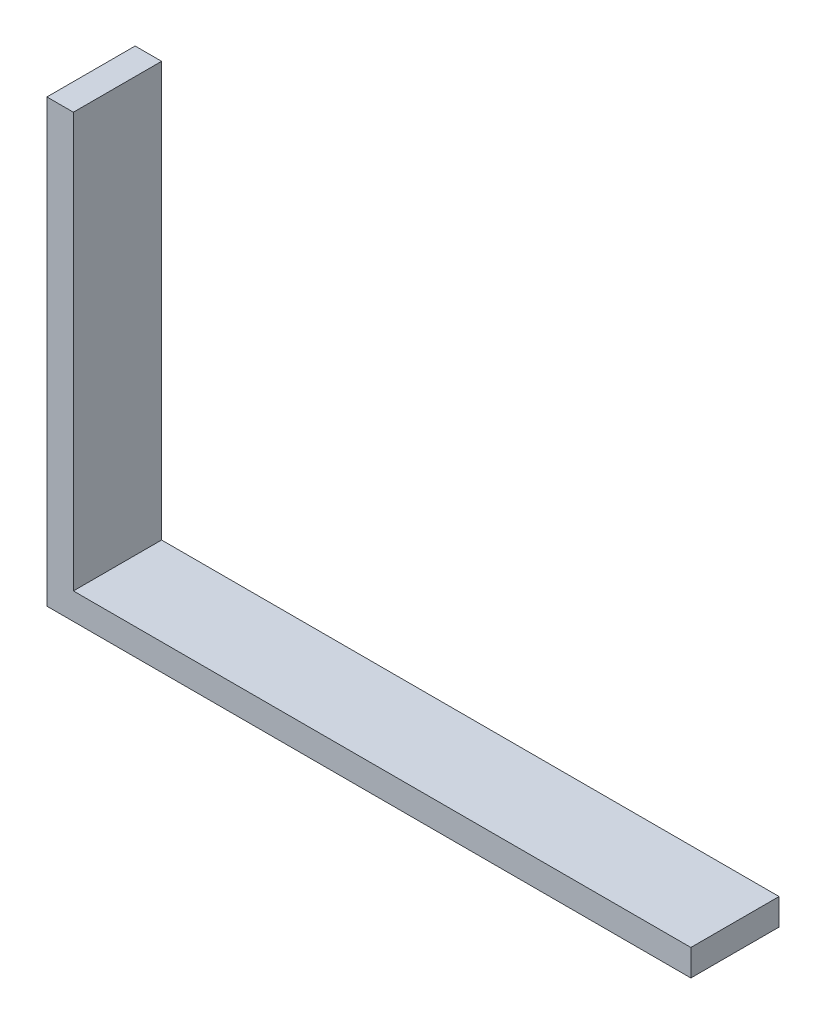
ISO-10303-21;
HEADER;
FILE_DESCRIPTION(('STEP AP214'),'2;1');
FILE_NAME('part.step','',(''),(''),'','','');
FILE_SCHEMA(('AUTOMOTIVE_DESIGN { 1 0 10303 214 1 1 1 1 }'));
ENDSEC;
DATA;
#1=APPLICATION_CONTEXT('core data for automotive mechanical design processes');
#2=APPLICATION_PROTOCOL_DEFINITION('international standard','automotive_design',2000,#1);
#3=PRODUCT_CONTEXT('',#1,'mechanical');
#4=PRODUCT('Part','Part','',(#3));
#5=PRODUCT_RELATED_PRODUCT_CATEGORY('part','',(#4));
#6=PRODUCT_DEFINITION_FORMATION('','',#4);
#7=PRODUCT_DEFINITION_CONTEXT('part definition',#1,'design');
#8=PRODUCT_DEFINITION('design','',#6,#7);
#9=PRODUCT_DEFINITION_SHAPE('','',#8);
#10=(LENGTH_UNIT() NAMED_UNIT(*) SI_UNIT(.MILLI.,.METRE.));
#11=(NAMED_UNIT(*) PLANE_ANGLE_UNIT() SI_UNIT($,.RADIAN.));
#12=(NAMED_UNIT(*) SI_UNIT($,.STERADIAN.) SOLID_ANGLE_UNIT());
#13=UNCERTAINTY_MEASURE_WITH_UNIT(LENGTH_MEASURE(1.E-05),#10,'distance_accuracy_value','');
#14=(GEOMETRIC_REPRESENTATION_CONTEXT(3) GLOBAL_UNCERTAINTY_ASSIGNED_CONTEXT((#13)) GLOBAL_UNIT_ASSIGNED_CONTEXT((#10,
#11,#12)) REPRESENTATION_CONTEXT('',''));
#15=CARTESIAN_POINT('',(0.,0.,0.));
#16=DIRECTION('',(0.,0.,1.));
#17=DIRECTION('',(1.,0.,0.));
#18=AXIS2_PLACEMENT_3D('',#15,#16,#17);
#19=CARTESIAN_POINT('',(73.,0.,10.));
#20=DIRECTION('',(0.,1.,0.));
#21=DIRECTION('',(-1.,0.,0.));
#22=AXIS2_PLACEMENT_3D('',#19,#20,#21);
#23=PLANE('',#22);
#24=DIRECTION('',(1.,0.,0.));
#25=VECTOR('',#24,1.);
#26=CARTESIAN_POINT('',(73.,0.,0.));
#27=LINE('',#26,#25);
#28=CARTESIAN_POINT('',(0.,0.,0.));
#29=VERTEX_POINT('',#28);
#30=CARTESIAN_POINT('',(73.,0.,0.));
#31=VERTEX_POINT('',#30);
#32=EDGE_CURVE('E117',#29,#31,#27,.T.);
#33=ORIENTED_EDGE('',*,*,#32,.T.);
#34=DIRECTION('',(0.,0.,-1.));
#35=VECTOR('',#34,1.);
#36=CARTESIAN_POINT('',(73.,0.,10.));
#37=LINE('',#36,#35);
#38=CARTESIAN_POINT('',(73.,0.,10.));
#39=VERTEX_POINT('',#38);
#40=EDGE_CURVE('E11',#39,#31,#37,.T.);
#41=ORIENTED_EDGE('',*,*,#40,.F.);
#42=DIRECTION('',(1.,0.,0.));
#43=VECTOR('',#42,1.);
#44=CARTESIAN_POINT('',(73.,0.,10.));
#45=LINE('',#44,#43);
#46=CARTESIAN_POINT('',(0.,0.,10.));
#47=VERTEX_POINT('',#46);
#48=EDGE_CURVE('E127',#47,#39,#45,.T.);
#49=ORIENTED_EDGE('',*,*,#48,.F.);
#50=DIRECTION('',(0.,0.,-1.));
#51=VECTOR('',#50,1.);
#52=CARTESIAN_POINT('',(0.,0.,10.));
#53=LINE('',#52,#51);
#54=EDGE_CURVE('E113',#47,#29,#53,.T.);
#55=ORIENTED_EDGE('',*,*,#54,.T.);
#56=EDGE_LOOP('',(#33,#41,#49,#55));
#57=FACE_BOUND('',#56,.T.);
#58=ADVANCED_FACE('F33',(#57),#23,.F.);
#59=CARTESIAN_POINT('',(73.,3.,10.));
#60=DIRECTION('',(-1.,0.,0.));
#61=DIRECTION('',(0.,0.,1.));
#62=AXIS2_PLACEMENT_3D('',#59,#60,#61);
#63=PLANE('',#62);
#64=DIRECTION('',(0.,1.,0.));
#65=VECTOR('',#64,1.);
#66=CARTESIAN_POINT('',(73.,3.,0.));
#67=LINE('',#66,#65);
#68=CARTESIAN_POINT('',(73.,3.,0.));
#69=VERTEX_POINT('',#68);
#70=EDGE_CURVE('E120',#31,#69,#67,.T.);
#71=ORIENTED_EDGE('',*,*,#70,.T.);
#72=DIRECTION('',(0.,0.,-1.));
#73=VECTOR('',#72,1.);
#74=CARTESIAN_POINT('',(73.,3.,10.));
#75=LINE('',#74,#73);
#76=CARTESIAN_POINT('',(73.,3.,10.));
#77=VERTEX_POINT('',#76);
#78=EDGE_CURVE('E41',#77,#69,#75,.T.);
#79=ORIENTED_EDGE('',*,*,#78,.F.);
#80=DIRECTION('',(0.,1.,0.));
#81=VECTOR('',#80,1.);
#82=CARTESIAN_POINT('',(73.,3.,10.));
#83=LINE('',#82,#81);
#84=EDGE_CURVE('E86',#39,#77,#83,.T.);
#85=ORIENTED_EDGE('',*,*,#84,.F.);
#86=ORIENTED_EDGE('',*,*,#40,.T.);
#87=EDGE_LOOP('',(#71,#79,#85,#86));
#88=FACE_BOUND('',#87,.T.);
#89=ADVANCED_FACE('F151',(#88),#63,.F.);
#90=CARTESIAN_POINT('',(3.00000000000001,3.,10.));
#91=DIRECTION('',(0.,-1.,0.));
#92=DIRECTION('',(0.,0.,-1.));
#93=AXIS2_PLACEMENT_3D('',#90,#91,#92);
#94=PLANE('',#93);
#95=DIRECTION('',(-1.,0.,0.));
#96=VECTOR('',#95,1.);
#97=CARTESIAN_POINT('',(3.00000000000001,3.,0.));
#98=LINE('',#97,#96);
#99=CARTESIAN_POINT('',(3.00000000000001,3.,0.));
#100=VERTEX_POINT('',#99);
#101=EDGE_CURVE('E122',#69,#100,#98,.T.);
#102=ORIENTED_EDGE('',*,*,#101,.T.);
#103=DIRECTION('',(0.,0.,-1.));
#104=VECTOR('',#103,1.);
#105=CARTESIAN_POINT('',(3.00000000000001,3.,10.));
#106=LINE('',#105,#104);
#107=CARTESIAN_POINT('',(3.00000000000001,3.,10.));
#108=VERTEX_POINT('',#107);
#109=EDGE_CURVE('E108',#108,#100,#106,.T.);
#110=ORIENTED_EDGE('',*,*,#109,.F.);
#111=DIRECTION('',(-1.,0.,0.));
#112=VECTOR('',#111,1.);
#113=CARTESIAN_POINT('',(3.00000000000001,3.,10.));
#114=LINE('',#113,#112);
#115=EDGE_CURVE('E99',#77,#108,#114,.T.);
#116=ORIENTED_EDGE('',*,*,#115,.F.);
#117=ORIENTED_EDGE('',*,*,#78,.T.);
#118=EDGE_LOOP('',(#102,#110,#116,#117));
#119=FACE_BOUND('',#118,.T.);
#120=ADVANCED_FACE('F133',(#119),#94,.F.);
#121=CARTESIAN_POINT('',(3.,50.,10.));
#122=DIRECTION('',(-1.,0.,0.));
#123=DIRECTION('',(0.,-1.,0.));
#124=AXIS2_PLACEMENT_3D('',#121,#122,#123);
#125=PLANE('',#124);
#126=DIRECTION('',(0.,1.,0.));
#127=VECTOR('',#126,1.);
#128=CARTESIAN_POINT('',(3.,50.,0.));
#129=LINE('',#128,#127);
#130=CARTESIAN_POINT('',(3.,50.,0.));
#131=VERTEX_POINT('',#130);
#132=EDGE_CURVE('E107',#100,#131,#129,.T.);
#133=ORIENTED_EDGE('',*,*,#132,.T.);
#134=DIRECTION('',(0.,0.,-1.));
#135=VECTOR('',#134,1.);
#136=CARTESIAN_POINT('',(3.,50.,10.));
#137=LINE('',#136,#135);
#138=CARTESIAN_POINT('',(3.,50.,10.));
#139=VERTEX_POINT('',#138);
#140=EDGE_CURVE('E104',#139,#131,#137,.T.);
#141=ORIENTED_EDGE('',*,*,#140,.F.);
#142=DIRECTION('',(0.,1.,0.));
#143=VECTOR('',#142,1.);
#144=CARTESIAN_POINT('',(3.,50.,10.));
#145=LINE('',#144,#143);
#146=EDGE_CURVE('E93',#108,#139,#145,.T.);
#147=ORIENTED_EDGE('',*,*,#146,.F.);
#148=ORIENTED_EDGE('',*,*,#109,.T.);
#149=EDGE_LOOP('',(#133,#141,#147,#148));
#150=FACE_BOUND('',#149,.T.);
#151=ADVANCED_FACE('F105',(#150),#125,.F.);
#152=CARTESIAN_POINT('',(0.,50.,10.));
#153=DIRECTION('',(0.,-1.,0.));
#154=DIRECTION('',(0.,0.,-1.));
#155=AXIS2_PLACEMENT_3D('',#152,#153,#154);
#156=PLANE('',#155);
#157=DIRECTION('',(-1.,0.,0.));
#158=VECTOR('',#157,1.);
#159=CARTESIAN_POINT('',(0.,50.,0.));
#160=LINE('',#159,#158);
#161=CARTESIAN_POINT('',(0.,50.,0.));
#162=VERTEX_POINT('',#161);
#163=EDGE_CURVE('E72',#131,#162,#160,.T.);
#164=ORIENTED_EDGE('',*,*,#163,.T.);
#165=DIRECTION('',(0.,0.,-1.));
#166=VECTOR('',#165,1.);
#167=CARTESIAN_POINT('',(0.,50.,10.));
#168=LINE('',#167,#166);
#169=CARTESIAN_POINT('',(0.,50.,10.));
#170=VERTEX_POINT('',#169);
#171=EDGE_CURVE('E109',#170,#162,#168,.T.);
#172=ORIENTED_EDGE('',*,*,#171,.F.);
#173=DIRECTION('',(-1.,0.,0.));
#174=VECTOR('',#173,1.);
#175=CARTESIAN_POINT('',(0.,50.,10.));
#176=LINE('',#175,#174);
#177=EDGE_CURVE('E97',#139,#170,#176,.T.);
#178=ORIENTED_EDGE('',*,*,#177,.F.);
#179=ORIENTED_EDGE('',*,*,#140,.T.);
#180=EDGE_LOOP('',(#164,#172,#178,#179));
#181=FACE_BOUND('',#180,.T.);
#182=ADVANCED_FACE('F111',(#181),#156,.F.);
#183=CARTESIAN_POINT('',(0.,0.,10.));
#184=DIRECTION('',(1.,0.,0.));
#185=DIRECTION('',(0.,0.,-1.));
#186=AXIS2_PLACEMENT_3D('',#183,#184,#185);
#187=PLANE('',#186);
#188=DIRECTION('',(0.,-1.,0.));
#189=VECTOR('',#188,1.);
#190=CARTESIAN_POINT('',(0.,0.,0.));
#191=LINE('',#190,#189);
#192=EDGE_CURVE('E78',#162,#29,#191,.T.);
#193=ORIENTED_EDGE('',*,*,#192,.T.);
#194=ORIENTED_EDGE('',*,*,#54,.F.);
#195=DIRECTION('',(0.,-1.,0.));
#196=VECTOR('',#195,1.);
#197=CARTESIAN_POINT('',(0.,0.,10.));
#198=LINE('',#197,#196);
#199=EDGE_CURVE('E49',#170,#47,#198,.T.);
#200=ORIENTED_EDGE('',*,*,#199,.F.);
#201=ORIENTED_EDGE('',*,*,#171,.T.);
#202=EDGE_LOOP('',(#193,#194,#200,#201));
#203=FACE_BOUND('',#202,.T.);
#204=ADVANCED_FACE('F140',(#203),#187,.F.);
#205=CARTESIAN_POINT('',(0.,0.,10.));
#206=DIRECTION('',(0.,0.,-1.));
#207=DIRECTION('',(-1.,0.,0.));
#208=AXIS2_PLACEMENT_3D('',#205,#206,#207);
#209=PLANE('',#208);
#210=ORIENTED_EDGE('',*,*,#48,.T.);
#211=ORIENTED_EDGE('',*,*,#84,.T.);
#212=ORIENTED_EDGE('',*,*,#115,.T.);
#213=ORIENTED_EDGE('',*,*,#146,.T.);
#214=ORIENTED_EDGE('',*,*,#177,.T.);
#215=ORIENTED_EDGE('',*,*,#199,.T.);
#216=EDGE_LOOP('',(#210,#211,#212,#213,#214,#215));
#217=FACE_BOUND('',#216,.T.);
#218=ADVANCED_FACE('F95',(#217),#209,.F.);
#219=CARTESIAN_POINT('',(0.,0.,0.));
#220=DIRECTION('',(0.,0.,-1.));
#221=DIRECTION('',(-1.,0.,0.));
#222=AXIS2_PLACEMENT_3D('',#219,#220,#221);
#223=PLANE('',#222);
#224=ORIENTED_EDGE('',*,*,#32,.F.);
#225=ORIENTED_EDGE('',*,*,#192,.F.);
#226=ORIENTED_EDGE('',*,*,#163,.F.);
#227=ORIENTED_EDGE('',*,*,#132,.F.);
#228=ORIENTED_EDGE('',*,*,#101,.F.);
#229=ORIENTED_EDGE('',*,*,#70,.F.);
#230=EDGE_LOOP('',(#224,#225,#226,#227,#228,#229));
#231=FACE_BOUND('',#230,.T.);
#232=ADVANCED_FACE('F136',(#231),#223,.T.);
#233=CLOSED_SHELL('',(#58,#89,#120,#151,#182,#204,#218,#232));
#234=MANIFOLD_SOLID_BREP('B2',#233);
#235=ADVANCED_BREP_SHAPE_REPRESENTATION('',(#18,#234),#14);
#236=SHAPE_DEFINITION_REPRESENTATION(#9,#235);
ENDSEC;
END-ISO-10303-21;
